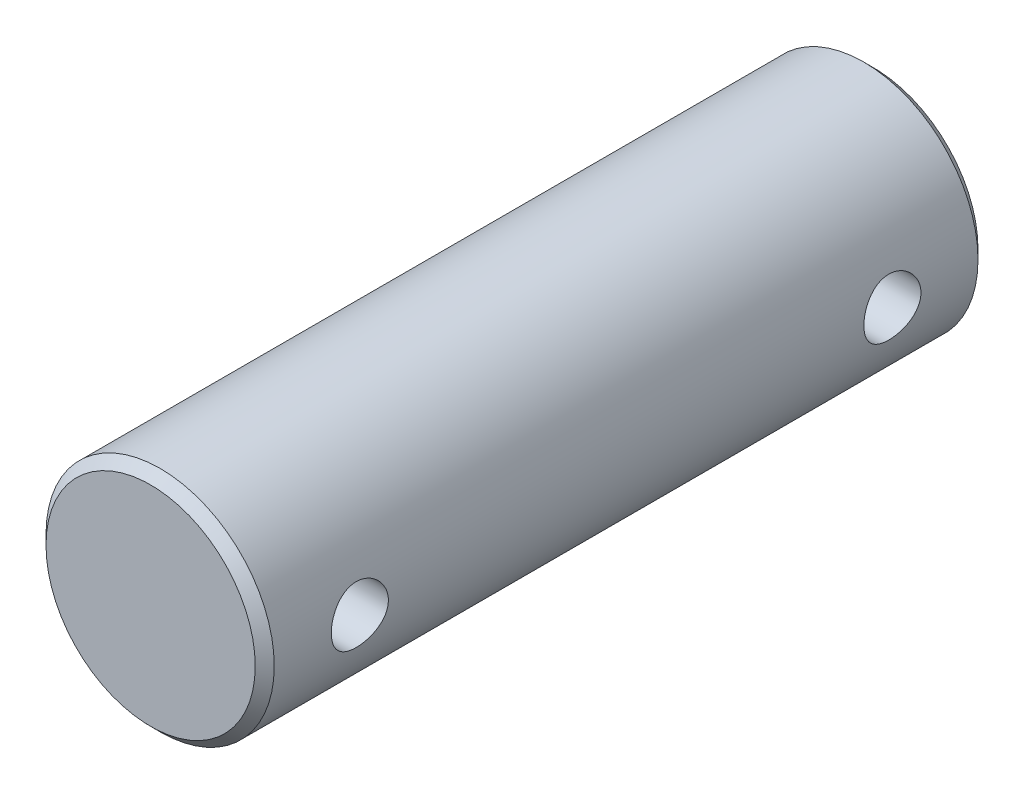
ISO-10303-21;
HEADER;
FILE_DESCRIPTION(('STEP AP214'),'2;1');
FILE_NAME('part.step','',(''),(''),'','','');
FILE_SCHEMA(('AUTOMOTIVE_DESIGN { 1 0 10303 214 1 1 1 1 }'));
ENDSEC;
DATA;
#1=APPLICATION_CONTEXT('core data for automotive mechanical design processes');
#2=APPLICATION_PROTOCOL_DEFINITION('international standard','automotive_design',2000,#1);
#3=PRODUCT_CONTEXT('',#1,'mechanical');
#4=PRODUCT('Part','Part','',(#3));
#5=PRODUCT_RELATED_PRODUCT_CATEGORY('part','',(#4));
#6=PRODUCT_DEFINITION_FORMATION('','',#4);
#7=PRODUCT_DEFINITION_CONTEXT('part definition',#1,'design');
#8=PRODUCT_DEFINITION('design','',#6,#7);
#9=PRODUCT_DEFINITION_SHAPE('','',#8);
#10=(LENGTH_UNIT() NAMED_UNIT(*) SI_UNIT(.MILLI.,.METRE.));
#11=(NAMED_UNIT(*) PLANE_ANGLE_UNIT() SI_UNIT($,.RADIAN.));
#12=(NAMED_UNIT(*) SI_UNIT($,.STERADIAN.) SOLID_ANGLE_UNIT());
#13=UNCERTAINTY_MEASURE_WITH_UNIT(LENGTH_MEASURE(1.E-05),#10,'distance_accuracy_value','');
#14=(GEOMETRIC_REPRESENTATION_CONTEXT(3) GLOBAL_UNCERTAINTY_ASSIGNED_CONTEXT((#13)) GLOBAL_UNIT_ASSIGNED_CONTEXT((#10,
#11,#12)) REPRESENTATION_CONTEXT('',''));
#15=CARTESIAN_POINT('',(0.,0.,0.));
#16=DIRECTION('',(0.,0.,1.));
#17=DIRECTION('',(1.,0.,0.));
#18=AXIS2_PLACEMENT_3D('',#15,#16,#17);
#19=CARTESIAN_POINT('',(0.,0.,19.));
#20=DIRECTION('',(0.,0.,-1.));
#21=DIRECTION('',(-1.,0.,0.));
#22=AXIS2_PLACEMENT_3D('',#19,#20,#21);
#23=CYLINDRICAL_SURFACE('',#22,3.);
#24=CARTESIAN_POINT('',(0.,0.,0.25));
#25=DIRECTION('',(0.,0.,1.));
#26=DIRECTION('',(1.,0.,0.));
#27=AXIS2_PLACEMENT_3D('',#24,#25,#26);
#28=CIRCLE('',#27,3.);
#29=CARTESIAN_POINT('',(3.,0.,0.25));
#30=VERTEX_POINT('',#29);
#31=EDGE_CURVE('E50',#30,#30,#28,.T.);
#32=ORIENTED_EDGE('',*,*,#31,.T.);
#33=EDGE_LOOP('',(#32));
#34=FACE_BOUND('',#33,.T.);
#35=CARTESIAN_POINT('',(0.,0.,18.75));
#36=DIRECTION('',(0.,0.,1.));
#37=DIRECTION('',(1.,0.,0.));
#38=AXIS2_PLACEMENT_3D('',#35,#36,#37);
#39=CIRCLE('',#38,3.);
#40=CARTESIAN_POINT('',(3.,0.,18.75));
#41=VERTEX_POINT('',#40);
#42=EDGE_CURVE('E54',#41,#41,#39,.F.);
#43=ORIENTED_EDGE('',*,*,#42,.T.);
#44=EDGE_LOOP('',(#43));
#45=FACE_BOUND('',#44,.T.);
#46=CARTESIAN_POINT('',(-3.,0.,3.25));
#47=CARTESIAN_POINT('',(-2.99999929934006,-0.0414380443348658,3.24999883713092));
#48=CARTESIAN_POINT('',(-2.99913289065914,-0.0828890789153821,3.2465542246131));
#49=CARTESIAN_POINT('',(-2.99576056914946,-0.164603161885267,3.2328874243465));
#50=CARTESIAN_POINT('',(-2.99325372709984,-0.20486552343537,3.22266139523108));
#51=CARTESIAN_POINT('',(-2.9868781316602,-0.283010436091288,3.19578037326896));
#52=CARTESIAN_POINT('',(-2.98301101421043,-0.320895781715001,3.17913310064236));
#53=CARTESIAN_POINT('',(-2.97432671903797,-0.393336065952213,3.13990930497758));
#54=CARTESIAN_POINT('',(-2.96950950927025,-0.427890892174379,3.11733258194053));
#55=CARTESIAN_POINT('',(-2.95933706795901,-0.493400963650459,3.06639960517289));
#56=CARTESIAN_POINT('',(-2.95397353574266,-0.524277845030536,3.03794421252041));
#57=CARTESIAN_POINT('',(-2.94336810058765,-0.580874463601652,2.97627389754554));
#58=CARTESIAN_POINT('',(-2.93812621144174,-0.606593618474567,2.94305843852675));
#59=CARTESIAN_POINT('',(-2.92827387849855,-0.652513271399516,2.87220238663128));
#60=CARTESIAN_POINT('',(-2.92367397235303,-0.672626107962678,2.8345033845948));
#61=CARTESIAN_POINT('',(-2.91574747406112,-0.706198454275263,2.75612579417082));
#62=CARTESIAN_POINT('',(-2.91242067836394,-0.719659027719666,2.71544768333712));
#63=CARTESIAN_POINT('',(-2.90750238358775,-0.739277418402145,2.63312825089876));
#64=CARTESIAN_POINT('',(-2.90587745537713,-0.745576134166669,2.5915225519751));
#65=CARTESIAN_POINT('',(-2.9044468126887,-0.751130887533926,2.50781571549301));
#66=CARTESIAN_POINT('',(-2.90464080224322,-0.750388070908989,2.4657146596507));
#67=CARTESIAN_POINT('',(-2.90679602748309,-0.74199326231964,2.38329209612776));
#68=CARTESIAN_POINT('',(-2.9087143150094,-0.73450917009526,2.34295218926745));
#69=CARTESIAN_POINT('',(-2.91403354838242,-0.713112093451553,2.26411947454435));
#70=CARTESIAN_POINT('',(-2.91743459985348,-0.699198651034712,2.22562679848551));
#71=CARTESIAN_POINT('',(-2.92537556952093,-0.665194738968577,2.15113099187397));
#72=CARTESIAN_POINT('',(-2.92992663734711,-0.645043333616455,2.11515691410522));
#73=CARTESIAN_POINT('',(-2.93964855423193,-0.599178138007477,2.04704064512158));
#74=CARTESIAN_POINT('',(-2.94481951167368,-0.57346337440442,2.01489912596637));
#75=CARTESIAN_POINT('',(-2.95537940269891,-0.516331712340609,1.9543981921528));
#76=CARTESIAN_POINT('',(-2.96077034738986,-0.48477312908293,1.92617275496933));
#77=CARTESIAN_POINT('',(-2.97102982789393,-0.41730595875185,1.87538937876805));
#78=CARTESIAN_POINT('',(-2.97589834774708,-0.381397238853972,1.85283161286822));
#79=CARTESIAN_POINT('',(-2.98458866047091,-0.306057944340696,1.81397470688781));
#80=CARTESIAN_POINT('',(-2.98840680063863,-0.266615696604312,1.79769732987279));
#81=CARTESIAN_POINT('',(-2.99453958495709,-0.185438004071442,1.77204134714521));
#82=CARTESIAN_POINT('',(-2.99685451669641,-0.143702999575243,1.76266142179093));
#83=CARTESIAN_POINT('',(-2.99967749635687,-0.0602699851950138,1.75127121722058));
#84=CARTESIAN_POINT('',(-3.00023026754139,-0.0185983599941054,1.74907848696235));
#85=CARTESIAN_POINT('',(-2.99959402407225,0.0645164374007535,1.75162450102774));
#86=CARTESIAN_POINT('',(-2.99840516620923,0.105959629822297,1.75636262139957));
#87=CARTESIAN_POINT('',(-2.99444790563679,0.186807134388245,1.77248545419569));
#88=CARTESIAN_POINT('',(-2.99170317092906,0.226232559484377,1.78377063173849));
#89=CARTESIAN_POINT('',(-2.98494353317067,0.302628646226255,1.81255354201422));
#90=CARTESIAN_POINT('',(-2.98092850184946,0.339599059516317,1.83005190215659));
#91=CARTESIAN_POINT('',(-2.97196653963155,0.410761567214923,1.87111806443736));
#92=CARTESIAN_POINT('',(-2.96700433683466,0.444892720917915,1.89478805619838));
#93=CARTESIAN_POINT('',(-2.9567225459371,0.508763306821623,1.94739495439848));
#94=CARTESIAN_POINT('',(-2.95140289625852,0.538501979486503,1.97633276980845));
#95=CARTESIAN_POINT('',(-2.94084478480386,0.593495284036365,2.03950098042223));
#96=CARTESIAN_POINT('',(-2.93561152093641,0.618621933811016,2.07384385150121));
#97=CARTESIAN_POINT('',(-2.92596439188619,0.662755379506348,2.14636631723286));
#98=CARTESIAN_POINT('',(-2.92155049033513,0.681762447078968,2.18454574147988));
#99=CARTESIAN_POINT('',(-2.91409047367333,0.712975710304646,2.26345286120654));
#100=CARTESIAN_POINT('',(-2.91103627645953,0.725222198327032,2.304163814172));
#101=CARTESIAN_POINT('',(-2.90663372045092,0.742672829976889,2.38715481894455));
#102=CARTESIAN_POINT('',(-2.90528498859968,0.747878513739329,2.42943452551624));
#103=CARTESIAN_POINT('',(-2.90447450601978,0.751019295166997,2.5130605119276));
#104=CARTESIAN_POINT('',(-2.90495966364132,0.749158948890059,2.55439871756237));
#105=CARTESIAN_POINT('',(-2.90763954503921,0.738688639156433,2.63615194433399));
#106=CARTESIAN_POINT('',(-2.90983423445928,0.730078811343384,2.67656698400682));
#107=CARTESIAN_POINT('',(-2.91565630341361,0.706465659721397,2.7551042295327));
#108=CARTESIAN_POINT('',(-2.91927507618155,0.691500702340187,2.7932386526201));
#109=CARTESIAN_POINT('',(-2.92753877862414,0.655632456802535,2.86648269135684));
#110=CARTESIAN_POINT('',(-2.93218385060387,0.634728345017094,2.90159188659346));
#111=CARTESIAN_POINT('',(-2.94212817131756,0.586933874318568,2.96877731450101));
#112=CARTESIAN_POINT('',(-2.94744132415879,0.559901581456127,3.00075053671198));
#113=CARTESIAN_POINT('',(-2.95804013623143,0.500894685594868,3.0597735223977));
#114=CARTESIAN_POINT('',(-2.9633257886353,0.468918910630573,3.08682211505648));
#115=CARTESIAN_POINT('',(-2.97338827823831,0.400233793351295,3.1357056542823));
#116=CARTESIAN_POINT('',(-2.97815416682934,0.363449211158193,3.15743730683579));
#117=CARTESIAN_POINT('',(-2.98652462487559,0.286633029755238,3.19437373147026));
#118=CARTESIAN_POINT('',(-2.99013002599891,0.24660378171837,3.20958318032427));
#119=CARTESIAN_POINT('',(-2.99524029782771,0.172205126621736,3.23078591516483));
#120=CARTESIAN_POINT('',(-2.99701292526345,0.138190085454035,3.23797562152672));
#121=CARTESIAN_POINT('',(-2.99939302615974,0.0694530357681421,3.24758297181097));
#122=CARTESIAN_POINT('',(-3.00000058725447,0.0347310806213083,3.25000097465265));
#123=CARTESIAN_POINT('',(-3.,0.,3.25));
#124=B_SPLINE_CURVE_WITH_KNOTS('',3,(#46,#47,#48,#49,#50,#51,#52,#53,#54,#55,#56,#57,#58,#59,
#60,#61,#62,#63,#64,#65,#66,#67,#68,#69,#70,#71,#72,#73,#74,#75,#76,#77,#78,#79,#80,#81,#82,#83,
#84,#85,#86,#87,#88,#89,#90,#91,#92,#93,#94,#95,#96,#97,#98,#99,#100,#101,#102,#103,#104,#105,
#106,#107,#108,#109,#110,#111,#112,#113,#114,#115,#116,#117,#118,#119,#120,#121,#122,#123),
.UNSPECIFIED.,.T.,.F.,(4,2,2,2,2,2,2,2,2,2,2,2,2,2,2,2,2,2,2,2,2,2,2,2,2,2,2,2,2,2,2,2,2,2,2,2,
2,2,4),(0.,0.124186856235945,0.248444118881949,0.372552451143052,0.496664970084663,
0.623072177185694,0.749493647900309,0.877793237729033,1.00607230584684,1.13178147549715,
1.25747019056348,1.38011248503509,1.50276351733019,1.62665263936939,1.75056345418081,
1.87800750484509,2.00545544779123,2.13334114504557,2.26120236844321,2.38579154474638,
2.51036950556371,2.63310137257018,2.75584563661145,2.88076793782676,3.00571181504009,
3.13372254602238,3.26172759374754,3.38896127307018,3.51616711626204,3.63971890199306,
3.76326820478017,3.88608200279723,4.0089128406845,4.13494788204955,4.26101284885208,
4.38936092749794,4.51761681910675,4.62171121471074,4.72579778021519),.UNSPECIFIED.);
#125=CARTESIAN_POINT('',(-3.,0.,3.25));
#126=VERTEX_POINT('',#125);
#127=EDGE_CURVE('E59',#126,#126,#124,.T.);
#128=ORIENTED_EDGE('',*,*,#127,.T.);
#129=EDGE_LOOP('',(#128));
#130=FACE_BOUND('',#129,.T.);
#131=CARTESIAN_POINT('',(3.,0.,1.75));
#132=CARTESIAN_POINT('',(2.99999929934006,-0.0414380443348655,1.75000116286908));
#133=CARTESIAN_POINT('',(2.99913289065914,-0.0828890789153816,1.75344577538689));
#134=CARTESIAN_POINT('',(2.99576056914946,-0.164603161885266,1.7671125756535));
#135=CARTESIAN_POINT('',(2.99325372709984,-0.20486552343537,1.77733860476892));
#136=CARTESIAN_POINT('',(2.9868781316602,-0.283010436091288,1.80421962673104));
#137=CARTESIAN_POINT('',(2.98301101421043,-0.320895781715001,1.82086689935764));
#138=CARTESIAN_POINT('',(2.97432671903797,-0.393336065952213,1.86009069502242));
#139=CARTESIAN_POINT('',(2.96950950927025,-0.42789089217438,1.88266741805947));
#140=CARTESIAN_POINT('',(2.95933706795901,-0.49340096365046,1.93360039482711));
#141=CARTESIAN_POINT('',(2.95397353574266,-0.524277845030536,1.96205578747959));
#142=CARTESIAN_POINT('',(2.94336810058765,-0.580874463601652,2.02372610245446));
#143=CARTESIAN_POINT('',(2.93812621144174,-0.606593618474567,2.05694156147325));
#144=CARTESIAN_POINT('',(2.92827387849855,-0.652513271399516,2.12779761336872));
#145=CARTESIAN_POINT('',(2.92367397235303,-0.672626107962678,2.1654966154052));
#146=CARTESIAN_POINT('',(2.91574747406112,-0.706198454275263,2.24387420582918));
#147=CARTESIAN_POINT('',(2.91242067836394,-0.719659027719666,2.28455231666288));
#148=CARTESIAN_POINT('',(2.90750238358775,-0.739277418402145,2.36687174910124));
#149=CARTESIAN_POINT('',(2.90587745537713,-0.745576134166669,2.4084774480249));
#150=CARTESIAN_POINT('',(2.9044468126887,-0.751130887533926,2.49218428450699));
#151=CARTESIAN_POINT('',(2.90464080224322,-0.750388070908989,2.53428534034931));
#152=CARTESIAN_POINT('',(2.90679602748309,-0.74199326231964,2.61670790387224));
#153=CARTESIAN_POINT('',(2.9087143150094,-0.73450917009526,2.65704781073255));
#154=CARTESIAN_POINT('',(2.91403354838242,-0.713112093451553,2.73588052545565));
#155=CARTESIAN_POINT('',(2.91743459985348,-0.699198651034712,2.77437320151449));
#156=CARTESIAN_POINT('',(2.92537556952093,-0.665194738968577,2.84886900812603));
#157=CARTESIAN_POINT('',(2.92992663734711,-0.645043333616455,2.88484308589478));
#158=CARTESIAN_POINT('',(2.93964855423193,-0.599178138007477,2.95295935487842));
#159=CARTESIAN_POINT('',(2.94481951167368,-0.57346337440442,2.98510087403363));
#160=CARTESIAN_POINT('',(2.95537940269891,-0.516331712340609,3.0456018078472));
#161=CARTESIAN_POINT('',(2.96077034738986,-0.48477312908293,3.07382724503067));
#162=CARTESIAN_POINT('',(2.97102982789393,-0.41730595875185,3.12461062123195));
#163=CARTESIAN_POINT('',(2.97589834774708,-0.381397238853972,3.14716838713178));
#164=CARTESIAN_POINT('',(2.98458866047091,-0.306057944340696,3.18602529311219));
#165=CARTESIAN_POINT('',(2.98840680063863,-0.266615696604312,3.20230267012721));
#166=CARTESIAN_POINT('',(2.99453958495709,-0.185438004071441,3.22795865285479));
#167=CARTESIAN_POINT('',(2.99685451669641,-0.143702999575243,3.23733857820907));
#168=CARTESIAN_POINT('',(2.99967749635687,-0.0602699851950138,3.24872878277942));
#169=CARTESIAN_POINT('',(3.00023026754139,-0.0185983599941053,3.25092151303765));
#170=CARTESIAN_POINT('',(2.99959402407225,0.0645164374007537,3.24837549897226));
#171=CARTESIAN_POINT('',(2.99840516620923,0.105959629822297,3.24363737860043));
#172=CARTESIAN_POINT('',(2.99444790563679,0.186807134388246,3.22751454580431));
#173=CARTESIAN_POINT('',(2.99170317092906,0.226232559484377,3.21622936826151));
#174=CARTESIAN_POINT('',(2.98494353317067,0.302628646226256,3.18744645798578));
#175=CARTESIAN_POINT('',(2.98092850184946,0.339599059516317,3.16994809784341));
#176=CARTESIAN_POINT('',(2.97196653963155,0.410761567214924,3.12888193556264));
#177=CARTESIAN_POINT('',(2.96700433683466,0.444892720917915,3.10521194380162));
#178=CARTESIAN_POINT('',(2.9567225459371,0.508763306821623,3.05260504560151));
#179=CARTESIAN_POINT('',(2.95140289625852,0.538501979486504,3.02366723019155));
#180=CARTESIAN_POINT('',(2.94084478480386,0.593495284036365,2.96049901957777));
#181=CARTESIAN_POINT('',(2.93561152093641,0.618621933811016,2.92615614849879));
#182=CARTESIAN_POINT('',(2.92596439188619,0.662755379506349,2.85363368276714));
#183=CARTESIAN_POINT('',(2.92155049033513,0.681762447078968,2.81545425852012));
#184=CARTESIAN_POINT('',(2.91409047367333,0.712975710304646,2.73654713879346));
#185=CARTESIAN_POINT('',(2.91103627645953,0.725222198327032,2.695836185828));
#186=CARTESIAN_POINT('',(2.90663372045092,0.742672829976889,2.61284518105545));
#187=CARTESIAN_POINT('',(2.90528498859968,0.747878513739329,2.57056547448376));
#188=CARTESIAN_POINT('',(2.90447450601978,0.751019295166997,2.4869394880724));
#189=CARTESIAN_POINT('',(2.90495966364132,0.749158948890059,2.44560128243763));
#190=CARTESIAN_POINT('',(2.90763954503921,0.738688639156433,2.36384805566601));
#191=CARTESIAN_POINT('',(2.90983423445928,0.730078811343384,2.32343301599317));
#192=CARTESIAN_POINT('',(2.91565630341361,0.706465659721397,2.2448957704673));
#193=CARTESIAN_POINT('',(2.91927507618155,0.691500702340188,2.2067613473799));
#194=CARTESIAN_POINT('',(2.92753877862414,0.655632456802535,2.13351730864316));
#195=CARTESIAN_POINT('',(2.93218385060387,0.634728345017094,2.09840811340654));
#196=CARTESIAN_POINT('',(2.94212817131756,0.586933874318568,2.03122268549899));
#197=CARTESIAN_POINT('',(2.94744132415879,0.559901581456127,1.99924946328802));
#198=CARTESIAN_POINT('',(2.95804013623143,0.500894685594868,1.9402264776023));
#199=CARTESIAN_POINT('',(2.9633257886353,0.468918910630573,1.91317788494352));
#200=CARTESIAN_POINT('',(2.97338827823831,0.400233793351295,1.8642943457177));
#201=CARTESIAN_POINT('',(2.97815416682934,0.363449211158194,1.84256269316421));
#202=CARTESIAN_POINT('',(2.98652462487559,0.286633029755238,1.80562626852974));
#203=CARTESIAN_POINT('',(2.99013002599891,0.24660378171837,1.79041681967573));
#204=CARTESIAN_POINT('',(2.99524029782771,0.172205126621736,1.76921408483517));
#205=CARTESIAN_POINT('',(2.99701292526345,0.138190085454035,1.76202437847328));
#206=CARTESIAN_POINT('',(2.99939302615974,0.0694530357681421,1.75241702818903));
#207=CARTESIAN_POINT('',(3.00000058725447,0.0347310806213084,1.74999902534735));
#208=CARTESIAN_POINT('',(3.,0.,1.75));
#209=B_SPLINE_CURVE_WITH_KNOTS('',3,(#131,#132,#133,#134,#135,#136,#137,#138,#139,#140,#141,
#142,#143,#144,#145,#146,#147,#148,#149,#150,#151,#152,#153,#154,#155,#156,#157,#158,#159,#160,
#161,#162,#163,#164,#165,#166,#167,#168,#169,#170,#171,#172,#173,#174,#175,#176,#177,#178,#179,
#180,#181,#182,#183,#184,#185,#186,#187,#188,#189,#190,#191,#192,#193,#194,#195,#196,#197,#198,
#199,#200,#201,#202,#203,#204,#205,#206,#207,#208),.UNSPECIFIED.,.T.,.F.,(4,2,2,2,2,2,2,2,2,2,2,
2,2,2,2,2,2,2,2,2,2,2,2,2,2,2,2,2,2,2,2,2,2,2,2,2,2,2,4),(0.,0.124186856235945,0.24844411888195,
0.372552451143053,0.496664970084664,0.623072177185695,0.749493647900309,0.877793237729034,
1.00607230584684,1.13178147549715,1.25747019056348,1.38011248503509,1.50276351733019,
1.62665263936939,1.75056345418081,1.87800750484509,2.00545544779123,2.13334114504557,
2.26120236844321,2.38579154474638,2.51036950556371,2.63310137257019,2.75584563661145,
2.88076793782676,3.00571181504009,3.13372254602238,3.26172759374754,3.38896127307018,
3.51616711626204,3.63971890199306,3.76326820478017,3.88608200279723,4.0089128406845,
4.13494788204955,4.26101284885209,4.38936092749794,4.51761681910675,4.62171121471074,
4.7257977802152),.UNSPECIFIED.);
#210=CARTESIAN_POINT('',(3.,0.,1.75));
#211=VERTEX_POINT('',#210);
#212=EDGE_CURVE('E67',#211,#211,#209,.T.);
#213=ORIENTED_EDGE('',*,*,#212,.T.);
#214=EDGE_LOOP('',(#213));
#215=FACE_BOUND('',#214,.T.);
#216=CARTESIAN_POINT('',(-3.,0.,17.25));
#217=CARTESIAN_POINT('',(-2.99999929934006,-0.0414380443348656,17.2499988371309));
#218=CARTESIAN_POINT('',(-2.99913289065914,-0.0828890789153817,17.2465542246131));
#219=CARTESIAN_POINT('',(-2.99576056914946,-0.164603161885267,17.2328874243465));
#220=CARTESIAN_POINT('',(-2.99325372709984,-0.20486552343537,17.2226613952311));
#221=CARTESIAN_POINT('',(-2.9868781316602,-0.283010436091289,17.195780373269));
#222=CARTESIAN_POINT('',(-2.98301101421043,-0.320895781715002,17.1791331006424));
#223=CARTESIAN_POINT('',(-2.97432671903796,-0.393336065952214,17.1399093049776));
#224=CARTESIAN_POINT('',(-2.96950950927025,-0.427890892174381,17.1173325819405));
#225=CARTESIAN_POINT('',(-2.95933706795901,-0.493400963650462,17.0663996051729));
#226=CARTESIAN_POINT('',(-2.95397353574266,-0.524277845030539,17.0379442125204));
#227=CARTESIAN_POINT('',(-2.94336810058765,-0.580874463601655,16.9762738975455));
#228=CARTESIAN_POINT('',(-2.93812621144174,-0.60659361847457,16.9430584385268));
#229=CARTESIAN_POINT('',(-2.92827387849855,-0.652513271399518,16.8722023866313));
#230=CARTESIAN_POINT('',(-2.92367397235303,-0.67262610796268,16.8345033845948));
#231=CARTESIAN_POINT('',(-2.91574747406112,-0.706198454275265,16.7561257941708));
#232=CARTESIAN_POINT('',(-2.91242067836394,-0.719659027719668,16.7154476833371));
#233=CARTESIAN_POINT('',(-2.90750238358775,-0.739277418402146,16.6331282508988));
#234=CARTESIAN_POINT('',(-2.90587745537713,-0.745576134166671,16.5915225519751));
#235=CARTESIAN_POINT('',(-2.9044468126887,-0.751130887533928,16.507815715493));
#236=CARTESIAN_POINT('',(-2.90464080224322,-0.750388070908991,16.4657146596507));
#237=CARTESIAN_POINT('',(-2.90679602748309,-0.741993262319642,16.3832920961278));
#238=CARTESIAN_POINT('',(-2.9087143150094,-0.734509170095263,16.3429521892675));
#239=CARTESIAN_POINT('',(-2.91403354838242,-0.713112093451556,16.2641194745444));
#240=CARTESIAN_POINT('',(-2.91743459985348,-0.699198651034714,16.2256267984855));
#241=CARTESIAN_POINT('',(-2.92537556952093,-0.665194738968579,16.151130991874));
#242=CARTESIAN_POINT('',(-2.92992663734711,-0.645043333616457,16.1151569141052));
#243=CARTESIAN_POINT('',(-2.93964855423193,-0.599178138007478,16.0470406451216));
#244=CARTESIAN_POINT('',(-2.94481951167368,-0.57346337440442,16.0148991259664));
#245=CARTESIAN_POINT('',(-2.95537940269891,-0.51633171234061,15.9543981921528));
#246=CARTESIAN_POINT('',(-2.96077034738986,-0.484773129082932,15.9261727549693));
#247=CARTESIAN_POINT('',(-2.97102982789393,-0.417305958751853,15.875389378768));
#248=CARTESIAN_POINT('',(-2.97589834774708,-0.381397238853975,15.8528316128682));
#249=CARTESIAN_POINT('',(-2.98458866047091,-0.306057944340699,15.8139747068878));
#250=CARTESIAN_POINT('',(-2.98840680063863,-0.266615696604315,15.7976973298728));
#251=CARTESIAN_POINT('',(-2.99453958495709,-0.185438004071444,15.7720413471452));
#252=CARTESIAN_POINT('',(-2.99685451669641,-0.143702999575244,15.7626614217909));
#253=CARTESIAN_POINT('',(-2.99967749635687,-0.060269985195014,15.7512712172206));
#254=CARTESIAN_POINT('',(-3.00023026754139,-0.0185983599941054,15.7490784869623));
#255=CARTESIAN_POINT('',(-2.99959402407225,0.0645164374007538,15.7516245010277));
#256=CARTESIAN_POINT('',(-2.99840516620923,0.105959629822297,15.7563626213996));
#257=CARTESIAN_POINT('',(-2.99444790563679,0.186807134388246,15.7724854541957));
#258=CARTESIAN_POINT('',(-2.99170317092906,0.226232559484378,15.7837706317385));
#259=CARTESIAN_POINT('',(-2.98494353317067,0.302628646226256,15.8125535420142));
#260=CARTESIAN_POINT('',(-2.98092850184946,0.339599059516318,15.8300519021566));
#261=CARTESIAN_POINT('',(-2.97196653963155,0.410761567214924,15.8711180644374));
#262=CARTESIAN_POINT('',(-2.96700433683466,0.444892720917916,15.8947880561984));
#263=CARTESIAN_POINT('',(-2.9567225459371,0.508763306821624,15.9473949543985));
#264=CARTESIAN_POINT('',(-2.95140289625852,0.538501979486505,15.9763327698085));
#265=CARTESIAN_POINT('',(-2.94084478480386,0.593495284036367,16.0395009804222));
#266=CARTESIAN_POINT('',(-2.93561152093641,0.618621933811018,16.0738438515012));
#267=CARTESIAN_POINT('',(-2.92596439188619,0.66275537950635,16.1463663172329));
#268=CARTESIAN_POINT('',(-2.92155049033513,0.681762447078969,16.1845457414799));
#269=CARTESIAN_POINT('',(-2.91409047367333,0.712975710304647,16.2634528612065));
#270=CARTESIAN_POINT('',(-2.91103627645953,0.725222198327035,16.304163814172));
#271=CARTESIAN_POINT('',(-2.90663372045092,0.742672829976892,16.3871548189446));
#272=CARTESIAN_POINT('',(-2.90528498859968,0.747878513739331,16.4294345255162));
#273=CARTESIAN_POINT('',(-2.90447450601978,0.751019295166999,16.5130605119276));
#274=CARTESIAN_POINT('',(-2.90495966364132,0.749158948890061,16.5543987175624));
#275=CARTESIAN_POINT('',(-2.90763954503921,0.738688639156435,16.636151944334));
#276=CARTESIAN_POINT('',(-2.90983423445928,0.730078811343386,16.6765669840068));
#277=CARTESIAN_POINT('',(-2.91565630341361,0.7064656597214,16.7551042295327));
#278=CARTESIAN_POINT('',(-2.91927507618155,0.691500702340191,16.7932386526201));
#279=CARTESIAN_POINT('',(-2.92753877862414,0.655632456802538,16.8664826913568));
#280=CARTESIAN_POINT('',(-2.93218385060386,0.634728345017097,16.9015918865935));
#281=CARTESIAN_POINT('',(-2.94212817131756,0.586933874318571,16.968777314501));
#282=CARTESIAN_POINT('',(-2.94744132415879,0.55990158145613,17.000750536712));
#283=CARTESIAN_POINT('',(-2.95804013623143,0.500894685594869,17.0597735223977));
#284=CARTESIAN_POINT('',(-2.9633257886353,0.468918910630574,17.0868221150565));
#285=CARTESIAN_POINT('',(-2.97338827823831,0.400233793351295,17.1357056542823));
#286=CARTESIAN_POINT('',(-2.97815416682934,0.363449211158193,17.1574373068358));
#287=CARTESIAN_POINT('',(-2.98652462487559,0.286633029755238,17.1943737314703));
#288=CARTESIAN_POINT('',(-2.99013002599891,0.24660378171837,17.2095831803243));
#289=CARTESIAN_POINT('',(-2.99524029782771,0.172205126621737,17.2307859151648));
#290=CARTESIAN_POINT('',(-2.99701292526345,0.138190085454035,17.2379756215267));
#291=CARTESIAN_POINT('',(-2.99939302615974,0.0694530357681421,17.247582971811));
#292=CARTESIAN_POINT('',(-3.00000058725447,0.0347310806213084,17.2500009746527));
#293=CARTESIAN_POINT('',(-3.,0.,17.25));
#294=B_SPLINE_CURVE_WITH_KNOTS('',3,(#216,#217,#218,#219,#220,#221,#222,#223,#224,#225,#226,
#227,#228,#229,#230,#231,#232,#233,#234,#235,#236,#237,#238,#239,#240,#241,#242,#243,#244,#245,
#246,#247,#248,#249,#250,#251,#252,#253,#254,#255,#256,#257,#258,#259,#260,#261,#262,#263,#264,
#265,#266,#267,#268,#269,#270,#271,#272,#273,#274,#275,#276,#277,#278,#279,#280,#281,#282,#283,
#284,#285,#286,#287,#288,#289,#290,#291,#292,#293),.UNSPECIFIED.,.T.,.F.,(4,2,2,2,2,2,2,2,2,2,2,
2,2,2,2,2,2,2,2,2,2,2,2,2,2,2,2,2,2,2,2,2,2,2,2,2,2,2,4),(0.,0.124186856235945,0.24844411888195,
0.372552451143053,0.496664970084665,0.623072177185698,0.749493647900312,0.877793237729034,
1.00607230584684,1.13178147549715,1.25747019056349,1.38011248503509,1.50276351733019,
1.6266526393694,1.75056345418082,1.8780075048451,2.00545544779124,2.13334114504557,
2.26120236844322,2.38579154474639,2.51036950556372,2.63310137257019,2.75584563661146,
2.88076793782677,3.0057118150401,3.13372254602239,3.26172759374755,3.38896127307019,
3.51616711626205,3.63971890199307,3.76326820478018,3.88608200279724,4.00891284068451,
4.13494788204956,4.2610128488521,4.38936092749795,4.51761681910676,4.62171121471076,
4.72579778021521),.UNSPECIFIED.);
#295=CARTESIAN_POINT('',(-3.,0.,17.25));
#296=VERTEX_POINT('',#295);
#297=EDGE_CURVE('E94',#296,#296,#294,.T.);
#298=ORIENTED_EDGE('',*,*,#297,.T.);
#299=EDGE_LOOP('',(#298));
#300=FACE_BOUND('',#299,.T.);
#301=CARTESIAN_POINT('',(3.,0.,15.75));
#302=CARTESIAN_POINT('',(2.99999929934006,-0.0414380443348656,15.7500011628691));
#303=CARTESIAN_POINT('',(2.99913289065914,-0.0828890789153818,15.7534457753869));
#304=CARTESIAN_POINT('',(2.99576056914946,-0.164603161885267,15.7671125756535));
#305=CARTESIAN_POINT('',(2.99325372709984,-0.20486552343537,15.7773386047689));
#306=CARTESIAN_POINT('',(2.9868781316602,-0.283010436091289,15.804219626731));
#307=CARTESIAN_POINT('',(2.98301101421043,-0.320895781715002,15.8208668993576));
#308=CARTESIAN_POINT('',(2.97432671903796,-0.393336065952214,15.8600906950224));
#309=CARTESIAN_POINT('',(2.96950950927025,-0.427890892174381,15.8826674180595));
#310=CARTESIAN_POINT('',(2.95933706795901,-0.493400963650462,15.9336003948271));
#311=CARTESIAN_POINT('',(2.95397353574266,-0.524277845030538,15.9620557874796));
#312=CARTESIAN_POINT('',(2.94336810058765,-0.580874463601654,16.0237261024545));
#313=CARTESIAN_POINT('',(2.93812621144174,-0.606593618474569,16.0569415614732));
#314=CARTESIAN_POINT('',(2.92827387849855,-0.652513271399518,16.1277976133687));
#315=CARTESIAN_POINT('',(2.92367397235303,-0.67262610796268,16.1654966154052));
#316=CARTESIAN_POINT('',(2.91574747406112,-0.706198454275265,16.2438742058292));
#317=CARTESIAN_POINT('',(2.91242067836394,-0.719659027719668,16.2845523166629));
#318=CARTESIAN_POINT('',(2.90750238358775,-0.739277418402146,16.3668717491012));
#319=CARTESIAN_POINT('',(2.90587745537713,-0.745576134166671,16.4084774480249));
#320=CARTESIAN_POINT('',(2.9044468126887,-0.751130887533928,16.492184284507));
#321=CARTESIAN_POINT('',(2.90464080224322,-0.750388070908991,16.5342853403493));
#322=CARTESIAN_POINT('',(2.90679602748309,-0.741993262319642,16.6167079038722));
#323=CARTESIAN_POINT('',(2.9087143150094,-0.734509170095262,16.6570478107325));
#324=CARTESIAN_POINT('',(2.91403354838242,-0.713112093451556,16.7358805254556));
#325=CARTESIAN_POINT('',(2.91743459985348,-0.699198651034714,16.7743732015145));
#326=CARTESIAN_POINT('',(2.92537556952093,-0.66519473896858,16.848869008126));
#327=CARTESIAN_POINT('',(2.92992663734711,-0.645043333616458,16.8848430858948));
#328=CARTESIAN_POINT('',(2.93964855423193,-0.599178138007479,16.9529593548784));
#329=CARTESIAN_POINT('',(2.94481951167368,-0.573463374404421,16.9851008740336));
#330=CARTESIAN_POINT('',(2.95537940269891,-0.516331712340609,17.0456018078472));
#331=CARTESIAN_POINT('',(2.96077034738986,-0.48477312908293,17.0738272450307));
#332=CARTESIAN_POINT('',(2.97102982789393,-0.417305958751852,17.124610621232));
#333=CARTESIAN_POINT('',(2.97589834774708,-0.381397238853974,17.1471683871318));
#334=CARTESIAN_POINT('',(2.98458866047091,-0.306057944340699,17.1860252931122));
#335=CARTESIAN_POINT('',(2.98840680063863,-0.266615696604315,17.2023026701272));
#336=CARTESIAN_POINT('',(2.99453958495709,-0.185438004071444,17.2279586528548));
#337=CARTESIAN_POINT('',(2.99685451669641,-0.143702999575244,17.2373385782091));
#338=CARTESIAN_POINT('',(2.99967749635687,-0.060269985195014,17.2487287827794));
#339=CARTESIAN_POINT('',(3.00023026754139,-0.0185983599941053,17.2509215130377));
#340=CARTESIAN_POINT('',(2.99959402407225,0.0645164374007539,17.2483754989723));
#341=CARTESIAN_POINT('',(2.99840516620923,0.105959629822297,17.2436373786004));
#342=CARTESIAN_POINT('',(2.99444790563679,0.186807134388246,17.2275145458043));
#343=CARTESIAN_POINT('',(2.99170317092906,0.226232559484378,17.2162293682615));
#344=CARTESIAN_POINT('',(2.98494353317067,0.302628646226256,17.1874464579858));
#345=CARTESIAN_POINT('',(2.98092850184946,0.339599059516318,17.1699480978434));
#346=CARTESIAN_POINT('',(2.97196653963155,0.410761567214924,17.1288819355626));
#347=CARTESIAN_POINT('',(2.96700433683466,0.444892720917916,17.1052119438016));
#348=CARTESIAN_POINT('',(2.9567225459371,0.508763306821624,17.0526050456015));
#349=CARTESIAN_POINT('',(2.95140289625852,0.538501979486505,17.0236672301915));
#350=CARTESIAN_POINT('',(2.94084478480386,0.593495284036367,16.9604990195778));
#351=CARTESIAN_POINT('',(2.93561152093641,0.618621933811018,16.9261561484988));
#352=CARTESIAN_POINT('',(2.92596439188619,0.66275537950635,16.8536336827671));
#353=CARTESIAN_POINT('',(2.92155049033513,0.681762447078969,16.8154542585201));
#354=CARTESIAN_POINT('',(2.91409047367333,0.712975710304648,16.7365471387935));
#355=CARTESIAN_POINT('',(2.91103627645953,0.725222198327035,16.695836185828));
#356=CARTESIAN_POINT('',(2.90663372045092,0.742672829976892,16.6128451810554));
#357=CARTESIAN_POINT('',(2.90528498859968,0.747878513739331,16.5705654744838));
#358=CARTESIAN_POINT('',(2.90447450601978,0.751019295166999,16.4869394880724));
#359=CARTESIAN_POINT('',(2.90495966364132,0.749158948890061,16.4456012824376));
#360=CARTESIAN_POINT('',(2.90763954503921,0.738688639156435,16.363848055666));
#361=CARTESIAN_POINT('',(2.90983423445928,0.730078811343386,16.3234330159932));
#362=CARTESIAN_POINT('',(2.91565630341361,0.7064656597214,16.2448957704673));
#363=CARTESIAN_POINT('',(2.91927507618155,0.691500702340191,16.2067613473799));
#364=CARTESIAN_POINT('',(2.92753877862414,0.655632456802538,16.1335173086432));
#365=CARTESIAN_POINT('',(2.93218385060386,0.634728345017097,16.0984081134065));
#366=CARTESIAN_POINT('',(2.94212817131756,0.586933874318571,16.031222685499));
#367=CARTESIAN_POINT('',(2.94744132415879,0.559901581456129,15.999249463288));
#368=CARTESIAN_POINT('',(2.95804013623143,0.500894685594869,15.9402264776023));
#369=CARTESIAN_POINT('',(2.9633257886353,0.468918910630574,15.9131778849435));
#370=CARTESIAN_POINT('',(2.97338827823831,0.400233793351295,15.8642943457177));
#371=CARTESIAN_POINT('',(2.97815416682934,0.363449211158193,15.8425626931642));
#372=CARTESIAN_POINT('',(2.98652462487559,0.286633029755238,15.8056262685297));
#373=CARTESIAN_POINT('',(2.99013002599891,0.24660378171837,15.7904168196757));
#374=CARTESIAN_POINT('',(2.99524029782771,0.172205126621737,15.7692140848352));
#375=CARTESIAN_POINT('',(2.99701292526345,0.138190085454035,15.7620243784733));
#376=CARTESIAN_POINT('',(2.99939302615974,0.069453035768142,15.752417028189));
#377=CARTESIAN_POINT('',(3.00000058725447,0.0347310806213084,15.7499990253473));
#378=CARTESIAN_POINT('',(3.,0.,15.75));
#379=B_SPLINE_CURVE_WITH_KNOTS('',3,(#301,#302,#303,#304,#305,#306,#307,#308,#309,#310,#311,
#312,#313,#314,#315,#316,#317,#318,#319,#320,#321,#322,#323,#324,#325,#326,#327,#328,#329,#330,
#331,#332,#333,#334,#335,#336,#337,#338,#339,#340,#341,#342,#343,#344,#345,#346,#347,#348,#349,
#350,#351,#352,#353,#354,#355,#356,#357,#358,#359,#360,#361,#362,#363,#364,#365,#366,#367,#368,
#369,#370,#371,#372,#373,#374,#375,#376,#377,#378),.UNSPECIFIED.,.T.,.F.,(4,2,2,2,2,2,2,2,2,2,2,
2,2,2,2,2,2,2,2,2,2,2,2,2,2,2,2,2,2,2,2,2,2,2,2,2,2,2,4),(0.,0.124186856235945,0.24844411888195,
0.372552451143053,0.496664970084665,0.623072177185697,0.749493647900312,0.877793237729034,
1.00607230584684,1.13178147549715,1.25747019056348,1.38011248503509,1.50276351733019,
1.6266526393694,1.75056345418082,1.8780075048451,2.00545544779124,2.13334114504557,
2.26120236844322,2.38579154474639,2.51036950556372,2.63310137257019,2.75584563661146,
2.88076793782677,3.0057118150401,3.13372254602239,3.26172759374755,3.38896127307019,
3.51616711626205,3.63971890199307,3.76326820478018,3.88608200279724,4.00891284068451,
4.13494788204956,4.2610128488521,4.38936092749795,4.51761681910676,4.62171121471075,
4.72579778021521),.UNSPECIFIED.);
#380=CARTESIAN_POINT('',(3.,0.,15.75));
#381=VERTEX_POINT('',#380);
#382=EDGE_CURVE('E90',#381,#381,#379,.T.);
#383=ORIENTED_EDGE('',*,*,#382,.T.);
#384=EDGE_LOOP('',(#383));
#385=FACE_BOUND('',#384,.T.);
#386=ADVANCED_FACE('F38',(#34,#45,#130,#215,#300,#385),#23,.T.);
#387=CARTESIAN_POINT('',(0.,0.,19.));
#388=DIRECTION('',(0.,0.,1.));
#389=DIRECTION('',(1.,0.,0.));
#390=AXIS2_PLACEMENT_3D('',#387,#388,#389);
#391=PLANE('',#390);
#392=CARTESIAN_POINT('',(0.,0.,19.));
#393=DIRECTION('',(0.,0.,1.));
#394=DIRECTION('',(1.,0.,0.));
#395=AXIS2_PLACEMENT_3D('',#392,#393,#394);
#396=CIRCLE('',#395,2.75);
#397=CARTESIAN_POINT('',(2.75,0.,19.));
#398=VERTEX_POINT('',#397);
#399=EDGE_CURVE('E10',#398,#398,#396,.T.);
#400=ORIENTED_EDGE('',*,*,#399,.T.);
#401=EDGE_LOOP('',(#400));
#402=FACE_BOUND('',#401,.T.);
#403=ADVANCED_FACE('F87',(#402),#391,.T.);
#404=CARTESIAN_POINT('',(0.,0.,0.));
#405=DIRECTION('',(0.,0.,1.));
#406=DIRECTION('',(1.,0.,0.));
#407=AXIS2_PLACEMENT_3D('',#404,#405,#406);
#408=PLANE('',#407);
#409=CARTESIAN_POINT('',(0.,0.,0.));
#410=DIRECTION('',(0.,0.,1.));
#411=DIRECTION('',(1.,0.,0.));
#412=AXIS2_PLACEMENT_3D('',#409,#410,#411);
#413=CIRCLE('',#412,2.75);
#414=CARTESIAN_POINT('',(2.75,0.,0.));
#415=VERTEX_POINT('',#414);
#416=EDGE_CURVE('E46',#415,#415,#413,.F.);
#417=ORIENTED_EDGE('',*,*,#416,.T.);
#418=EDGE_LOOP('',(#417));
#419=FACE_BOUND('',#418,.T.);
#420=ADVANCED_FACE('F85',(#419),#408,.F.);
#421=CARTESIAN_POINT('',(-3.,0.,16.5));
#422=DIRECTION('',(1.,0.,0.));
#423=DIRECTION('',(0.,0.,-1.));
#424=AXIS2_PLACEMENT_3D('',#421,#422,#423);
#425=CYLINDRICAL_SURFACE('',#424,0.750000000000002);
#426=ORIENTED_EDGE('',*,*,#382,.F.);
#427=EDGE_LOOP('',(#426));
#428=FACE_BOUND('',#427,.T.);
#429=ORIENTED_EDGE('',*,*,#297,.F.);
#430=EDGE_LOOP('',(#429));
#431=FACE_BOUND('',#430,.T.);
#432=ADVANCED_FACE('F79',(#428,#431),#425,.F.);
#433=CARTESIAN_POINT('',(-3.,0.,2.5));
#434=DIRECTION('',(1.,0.,0.));
#435=DIRECTION('',(0.,0.,-1.));
#436=AXIS2_PLACEMENT_3D('',#433,#434,#435);
#437=CYLINDRICAL_SURFACE('',#436,0.75);
#438=ORIENTED_EDGE('',*,*,#212,.F.);
#439=EDGE_LOOP('',(#438));
#440=FACE_BOUND('',#439,.T.);
#441=ORIENTED_EDGE('',*,*,#127,.F.);
#442=EDGE_LOOP('',(#441));
#443=FACE_BOUND('',#442,.T.);
#444=ADVANCED_FACE('F74',(#440,#443),#437,.F.);
#445=CARTESIAN_POINT('',(0.,0.,0.25));
#446=DIRECTION('',(0.,0.,1.));
#447=DIRECTION('',(1.,0.,0.));
#448=AXIS2_PLACEMENT_3D('',#445,#446,#447);
#449=CONICAL_SURFACE('',#448,3.,0.785398163397447);
#450=ORIENTED_EDGE('',*,*,#416,.F.);
#451=EDGE_LOOP('',(#450));
#452=FACE_BOUND('',#451,.T.);
#453=ORIENTED_EDGE('',*,*,#31,.F.);
#454=EDGE_LOOP('',(#453));
#455=FACE_BOUND('',#454,.T.);
#456=ADVANCED_FACE('F78',(#452,#455),#449,.T.);
#457=CARTESIAN_POINT('',(0.,0.,19.));
#458=DIRECTION('',(0.,0.,-1.));
#459=DIRECTION('',(-1.,0.,0.));
#460=AXIS2_PLACEMENT_3D('',#457,#458,#459);
#461=CONICAL_SURFACE('',#460,2.75,0.785398163397441);
#462=ORIENTED_EDGE('',*,*,#42,.F.);
#463=EDGE_LOOP('',(#462));
#464=FACE_BOUND('',#463,.T.);
#465=ORIENTED_EDGE('',*,*,#399,.F.);
#466=EDGE_LOOP('',(#465));
#467=FACE_BOUND('',#466,.T.);
#468=ADVANCED_FACE('F41',(#464,#467),#461,.T.);
#469=CLOSED_SHELL('',(#386,#403,#420,#432,#444,#456,#468));
#470=MANIFOLD_SOLID_BREP('B2',#469);
#471=ADVANCED_BREP_SHAPE_REPRESENTATION('',(#18,#470),#14);
#472=SHAPE_DEFINITION_REPRESENTATION(#9,#471);
ENDSEC;
END-ISO-10303-21;
